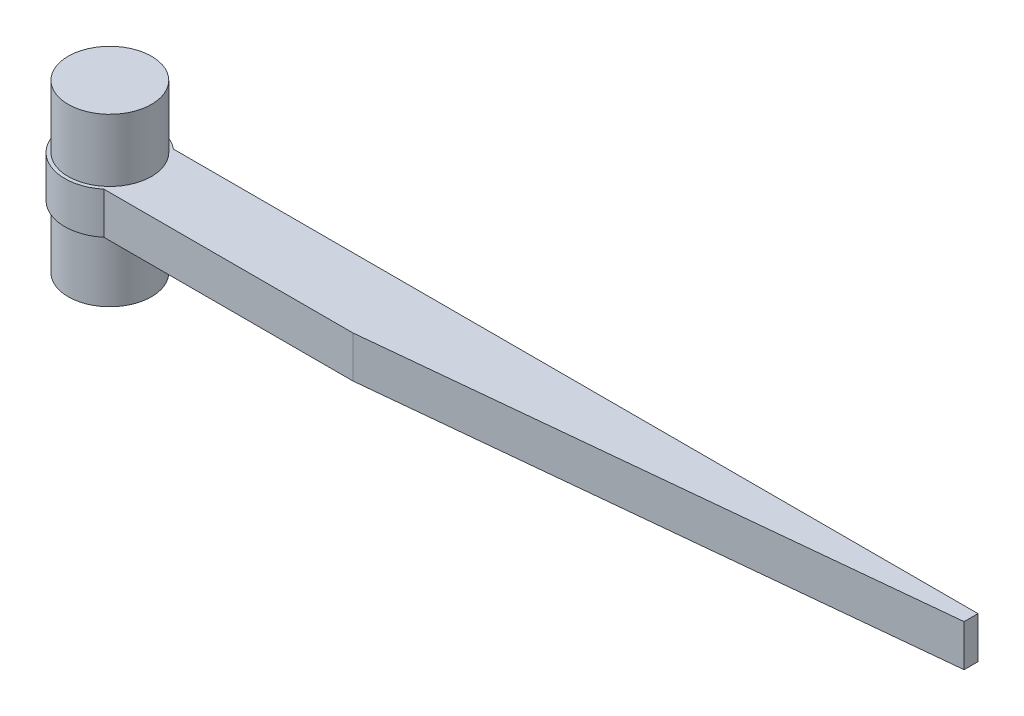
ISO-10303-21;
HEADER;
FILE_DESCRIPTION(('STEP AP214'),'2;1');
FILE_NAME('part.step','',(''),(''),'','','');
FILE_SCHEMA(('AUTOMOTIVE_DESIGN { 1 0 10303 214 1 1 1 1 }'));
ENDSEC;
DATA;
#1=APPLICATION_CONTEXT('core data for automotive mechanical design processes');
#2=APPLICATION_PROTOCOL_DEFINITION('international standard','automotive_design',2000,#1);
#3=PRODUCT_CONTEXT('',#1,'mechanical');
#4=PRODUCT('Part','Part','',(#3));
#5=PRODUCT_RELATED_PRODUCT_CATEGORY('part','',(#4));
#6=PRODUCT_DEFINITION_FORMATION('','',#4);
#7=PRODUCT_DEFINITION_CONTEXT('part definition',#1,'design');
#8=PRODUCT_DEFINITION('design','',#6,#7);
#9=PRODUCT_DEFINITION_SHAPE('','',#8);
#10=(LENGTH_UNIT() NAMED_UNIT(*) SI_UNIT(.MILLI.,.METRE.));
#11=(NAMED_UNIT(*) PLANE_ANGLE_UNIT() SI_UNIT($,.RADIAN.));
#12=(NAMED_UNIT(*) SI_UNIT($,.STERADIAN.) SOLID_ANGLE_UNIT());
#13=UNCERTAINTY_MEASURE_WITH_UNIT(LENGTH_MEASURE(1.E-05),#10,'distance_accuracy_value','');
#14=(GEOMETRIC_REPRESENTATION_CONTEXT(3) GLOBAL_UNCERTAINTY_ASSIGNED_CONTEXT((#13)) GLOBAL_UNIT_ASSIGNED_CONTEXT((#10,
#11,#12)) REPRESENTATION_CONTEXT('',''));
#15=CARTESIAN_POINT('',(0.,0.,0.));
#16=DIRECTION('',(0.,0.,1.));
#17=DIRECTION('',(1.,0.,0.));
#18=AXIS2_PLACEMENT_3D('',#15,#16,#17);
#19=CARTESIAN_POINT('',(0.,1.5,0.));
#20=DIRECTION('',(0.,-1.,0.));
#21=DIRECTION('',(0.,0.,-1.));
#22=AXIS2_PLACEMENT_3D('',#19,#20,#21);
#23=CYLINDRICAL_SURFACE('',#22,3.25);
#24=CARTESIAN_POINT('',(0.,-1.5,0.));
#25=DIRECTION('',(0.,1.,0.));
#26=DIRECTION('',(0.,0.,1.));
#27=AXIS2_PLACEMENT_3D('',#24,#25,#26);
#28=CIRCLE('',#27,3.25);
#29=CARTESIAN_POINT('',(2.07665596572952,-1.5,-2.5));
#30=VERTEX_POINT('',#29);
#31=CARTESIAN_POINT('',(2.07665596572952,-1.5,2.5));
#32=VERTEX_POINT('',#31);
#33=EDGE_CURVE('E92',#30,#32,#28,.T.);
#34=ORIENTED_EDGE('',*,*,#33,.T.);
#35=DIRECTION('',(0.,-1.,0.));
#36=VECTOR('',#35,1.);
#37=CARTESIAN_POINT('',(2.07665596572952,1.5,2.5));
#38=LINE('',#37,#36);
#39=CARTESIAN_POINT('',(2.07665596572952,1.5,2.5));
#40=VERTEX_POINT('',#39);
#41=EDGE_CURVE('E108',#32,#40,#38,.F.);
#42=ORIENTED_EDGE('',*,*,#41,.T.);
#43=CARTESIAN_POINT('',(0.,1.5,0.));
#44=DIRECTION('',(0.,1.,0.));
#45=DIRECTION('',(0.,0.,1.));
#46=AXIS2_PLACEMENT_3D('',#43,#44,#45);
#47=CIRCLE('',#46,3.25);
#48=CARTESIAN_POINT('',(2.07665596572952,1.5,-2.5));
#49=VERTEX_POINT('',#48);
#50=EDGE_CURVE('E120',#49,#40,#47,.T.);
#51=ORIENTED_EDGE('',*,*,#50,.F.);
#52=DIRECTION('',(0.,-1.,0.));
#53=VECTOR('',#52,1.);
#54=CARTESIAN_POINT('',(2.07665596572952,1.5,-2.5));
#55=LINE('',#54,#53);
#56=EDGE_CURVE('E83',#30,#49,#55,.F.);
#57=ORIENTED_EDGE('',*,*,#56,.F.);
#58=EDGE_LOOP('',(#34,#42,#51,#57));
#59=FACE_BOUND('',#58,.T.);
#60=ADVANCED_FACE('F32',(#59),#23,.T.);
#61=CARTESIAN_POINT('',(0.,1.5,0.));
#62=DIRECTION('',(0.,1.,0.));
#63=DIRECTION('',(0.,0.,1.));
#64=AXIS2_PLACEMENT_3D('',#61,#62,#63);
#65=PLANE('',#64);
#66=DIRECTION('',(-1.,0.,0.));
#67=VECTOR('',#66,1.);
#68=CARTESIAN_POINT('',(0.,1.5,2.5));
#69=LINE('',#68,#67);
#70=CARTESIAN_POINT('',(19.9999999999986,1.5,2.5));
#71=VERTEX_POINT('',#70);
#72=EDGE_CURVE('E105',#71,#40,#69,.T.);
#73=ORIENTED_EDGE('',*,*,#72,.F.);
#74=DIRECTION('',(0.995037190209989,0.,-0.0995037190209955));
#75=VECTOR('',#74,1.);
#76=CARTESIAN_POINT('',(0.445544554455409,1.5,4.45544554455425));
#77=LINE('',#76,#75);
#78=CARTESIAN_POINT('',(60.,1.5,-1.5));
#79=VERTEX_POINT('',#78);
#80=EDGE_CURVE('E54',#71,#79,#77,.T.);
#81=ORIENTED_EDGE('',*,*,#80,.T.);
#82=DIRECTION('',(0.,0.,-1.));
#83=VECTOR('',#82,1.);
#84=CARTESIAN_POINT('',(60.,1.5,2.5));
#85=LINE('',#84,#83);
#86=CARTESIAN_POINT('',(60.,1.5,-2.5));
#87=VERTEX_POINT('',#86);
#88=EDGE_CURVE('E84',#79,#87,#85,.T.);
#89=ORIENTED_EDGE('',*,*,#88,.T.);
#90=DIRECTION('',(-1.,0.,0.));
#91=VECTOR('',#90,1.);
#92=CARTESIAN_POINT('',(0.,1.5,-2.5));
#93=LINE('',#92,#91);
#94=EDGE_CURVE('E99',#87,#49,#93,.T.);
#95=ORIENTED_EDGE('',*,*,#94,.T.);
#96=ORIENTED_EDGE('',*,*,#50,.T.);
#97=EDGE_LOOP('',(#73,#81,#89,#95,#96));
#98=FACE_BOUND('',#97,.T.);
#99=CARTESIAN_POINT('',(0.,1.5,0.));
#100=DIRECTION('',(0.,1.,0.));
#101=DIRECTION('',(0.,0.,1.));
#102=AXIS2_PLACEMENT_3D('',#99,#100,#101);
#103=CIRCLE('',#102,3.);
#104=CARTESIAN_POINT('',(0.,1.5,3.));
#105=VERTEX_POINT('',#104);
#106=EDGE_CURVE('E115',#105,#105,#103,.F.);
#107=ORIENTED_EDGE('',*,*,#106,.T.);
#108=EDGE_LOOP('',(#107));
#109=FACE_BOUND('',#108,.T.);
#110=ADVANCED_FACE('F136',(#98,#109),#65,.T.);
#111=CARTESIAN_POINT('',(0.,-1.5,0.));
#112=DIRECTION('',(0.,1.,0.));
#113=DIRECTION('',(0.,0.,1.));
#114=AXIS2_PLACEMENT_3D('',#111,#112,#113);
#115=PLANE('',#114);
#116=DIRECTION('',(0.,0.,-1.));
#117=VECTOR('',#116,1.);
#118=CARTESIAN_POINT('',(60.,-1.5,2.5));
#119=LINE('',#118,#117);
#120=CARTESIAN_POINT('',(60.,-1.5,-1.5));
#121=VERTEX_POINT('',#120);
#122=CARTESIAN_POINT('',(60.,-1.5,-2.5));
#123=VERTEX_POINT('',#122);
#124=EDGE_CURVE('E75',#121,#123,#119,.T.);
#125=ORIENTED_EDGE('',*,*,#124,.F.);
#126=DIRECTION('',(-0.995037190209989,0.,0.0995037190209955));
#127=VECTOR('',#126,1.);
#128=CARTESIAN_POINT('',(19.9999999999986,-1.5,2.5));
#129=LINE('',#128,#127);
#130=CARTESIAN_POINT('',(19.9999999999986,-1.5,2.5));
#131=VERTEX_POINT('',#130);
#132=EDGE_CURVE('E11',#121,#131,#129,.T.);
#133=ORIENTED_EDGE('',*,*,#132,.T.);
#134=DIRECTION('',(1.,0.,0.));
#135=VECTOR('',#134,1.);
#136=CARTESIAN_POINT('',(0.,-1.5,2.5));
#137=LINE('',#136,#135);
#138=EDGE_CURVE('E101',#32,#131,#137,.T.);
#139=ORIENTED_EDGE('',*,*,#138,.F.);
#140=ORIENTED_EDGE('',*,*,#33,.F.);
#141=DIRECTION('',(1.,0.,0.));
#142=VECTOR('',#141,1.);
#143=CARTESIAN_POINT('',(0.,-1.5,-2.5));
#144=LINE('',#143,#142);
#145=EDGE_CURVE('E88',#30,#123,#144,.T.);
#146=ORIENTED_EDGE('',*,*,#145,.T.);
#147=EDGE_LOOP('',(#125,#133,#139,#140,#146));
#148=FACE_BOUND('',#147,.T.);
#149=CARTESIAN_POINT('',(0.,-1.5,0.));
#150=DIRECTION('',(0.,1.,0.));
#151=DIRECTION('',(0.,0.,1.));
#152=AXIS2_PLACEMENT_3D('',#149,#150,#151);
#153=CIRCLE('',#152,3.);
#154=CARTESIAN_POINT('',(0.,-1.5,3.));
#155=VERTEX_POINT('',#154);
#156=EDGE_CURVE('E123',#155,#155,#153,.F.);
#157=ORIENTED_EDGE('',*,*,#156,.F.);
#158=EDGE_LOOP('',(#157));
#159=FACE_BOUND('',#158,.T.);
#160=ADVANCED_FACE('F89',(#148,#159),#115,.F.);
#161=CARTESIAN_POINT('',(0.,-6.,0.));
#162=DIRECTION('',(0.,1.,0.));
#163=DIRECTION('',(0.,0.,1.));
#164=AXIS2_PLACEMENT_3D('',#161,#162,#163);
#165=PLANE('',#164);
#166=CARTESIAN_POINT('',(0.,-6.,0.));
#167=DIRECTION('',(0.,1.,0.));
#168=DIRECTION('',(0.,0.,1.));
#169=AXIS2_PLACEMENT_3D('',#166,#167,#168);
#170=CIRCLE('',#169,3.);
#171=CARTESIAN_POINT('',(0.,-6.,3.));
#172=VERTEX_POINT('',#171);
#173=EDGE_CURVE('E111',#172,#172,#170,.T.);
#174=ORIENTED_EDGE('',*,*,#173,.F.);
#175=EDGE_LOOP('',(#174));
#176=FACE_BOUND('',#175,.T.);
#177=ADVANCED_FACE('F260',(#176),#165,.F.);
#178=CARTESIAN_POINT('',(0.,6.,0.));
#179=DIRECTION('',(0.,-1.,0.));
#180=DIRECTION('',(0.,0.,-1.));
#181=AXIS2_PLACEMENT_3D('',#178,#179,#180);
#182=CYLINDRICAL_SURFACE('',#181,3.);
#183=ORIENTED_EDGE('',*,*,#173,.T.);
#184=EDGE_LOOP('',(#183));
#185=FACE_BOUND('',#184,.T.);
#186=ORIENTED_EDGE('',*,*,#156,.T.);
#187=EDGE_LOOP('',(#186));
#188=FACE_BOUND('',#187,.T.);
#189=ADVANCED_FACE('F266',(#185,#188),#182,.T.);
#190=ORIENTED_EDGE('',*,*,#106,.F.);
#191=EDGE_LOOP('',(#190));
#192=FACE_BOUND('',#191,.T.);
#193=CARTESIAN_POINT('',(0.,6.,0.));
#194=DIRECTION('',(0.,1.,0.));
#195=DIRECTION('',(0.,0.,1.));
#196=AXIS2_PLACEMENT_3D('',#193,#194,#195);
#197=CIRCLE('',#196,3.);
#198=CARTESIAN_POINT('',(0.,6.,3.));
#199=VERTEX_POINT('',#198);
#200=EDGE_CURVE('E112',#199,#199,#197,.T.);
#201=ORIENTED_EDGE('',*,*,#200,.F.);
#202=EDGE_LOOP('',(#201));
#203=FACE_BOUND('',#202,.T.);
#204=ADVANCED_FACE('F262',(#192,#203),#182,.T.);
#205=CARTESIAN_POINT('',(0.,6.,0.));
#206=DIRECTION('',(0.,1.,0.));
#207=DIRECTION('',(0.,0.,1.));
#208=AXIS2_PLACEMENT_3D('',#205,#206,#207);
#209=PLANE('',#208);
#210=ORIENTED_EDGE('',*,*,#200,.T.);
#211=EDGE_LOOP('',(#210));
#212=FACE_BOUND('',#211,.T.);
#213=ADVANCED_FACE('F265',(#212),#209,.T.);
#214=CARTESIAN_POINT('',(0.,0.,2.5));
#215=DIRECTION('',(0.,0.,1.));
#216=DIRECTION('',(1.,0.,0.));
#217=AXIS2_PLACEMENT_3D('',#214,#215,#216);
#218=PLANE('',#217);
#219=ORIENTED_EDGE('',*,*,#138,.T.);
#220=DIRECTION('',(0.,1.,0.));
#221=VECTOR('',#220,1.);
#222=CARTESIAN_POINT('',(19.9999999999986,1.5,2.5));
#223=LINE('',#222,#221);
#224=EDGE_CURVE('E127',#131,#71,#223,.T.);
#225=ORIENTED_EDGE('',*,*,#224,.T.);
#226=ORIENTED_EDGE('',*,*,#72,.T.);
#227=ORIENTED_EDGE('',*,*,#41,.F.);
#228=EDGE_LOOP('',(#219,#225,#226,#227));
#229=FACE_BOUND('',#228,.T.);
#230=ADVANCED_FACE('F133',(#229),#218,.T.);
#231=CARTESIAN_POINT('',(0.,0.,-2.5));
#232=DIRECTION('',(0.,0.,1.));
#233=DIRECTION('',(1.,0.,0.));
#234=AXIS2_PLACEMENT_3D('',#231,#232,#233);
#235=PLANE('',#234);
#236=CARTESIAN_POINT('',(56.0447280958672,-3.49148133884313E-13,-2.5));
#237=DIRECTION('',(0.,0.,-1.));
#238=DIRECTION('',(-1.,0.,0.));
#239=AXIS2_PLACEMENT_3D('',#236,#237,#238);
#240=CIRCLE('',#239,0.85);
#241=CARTESIAN_POINT('',(55.1947280958672,-3.49148133884313E-13,-2.5));
#242=VERTEX_POINT('',#241);
#243=EDGE_CURVE('E200',#242,#242,#240,.T.);
#244=ORIENTED_EDGE('',*,*,#243,.F.);
#245=EDGE_LOOP('',(#244));
#246=FACE_BOUND('',#245,.T.);
#247=CARTESIAN_POINT('',(51.0447280958672,-3.14233320495882E-13,-2.5));
#248=DIRECTION('',(0.,0.,-1.));
#249=DIRECTION('',(-1.,0.,0.));
#250=AXIS2_PLACEMENT_3D('',#247,#248,#249);
#251=CIRCLE('',#250,0.85);
#252=CARTESIAN_POINT('',(50.1947280958672,-3.14233320495882E-13,-2.5));
#253=VERTEX_POINT('',#252);
#254=EDGE_CURVE('E194',#253,#253,#251,.T.);
#255=ORIENTED_EDGE('',*,*,#254,.F.);
#256=EDGE_LOOP('',(#255));
#257=FACE_BOUND('',#256,.T.);
#258=CARTESIAN_POINT('',(46.0447280958672,-2.79318507107451E-13,-2.5));
#259=DIRECTION('',(0.,0.,-1.));
#260=DIRECTION('',(-1.,0.,0.));
#261=AXIS2_PLACEMENT_3D('',#258,#259,#260);
#262=CIRCLE('',#261,0.85);
#263=CARTESIAN_POINT('',(45.1947280958672,-2.79318507107451E-13,-2.5));
#264=VERTEX_POINT('',#263);
#265=EDGE_CURVE('E188',#264,#264,#262,.T.);
#266=ORIENTED_EDGE('',*,*,#265,.F.);
#267=EDGE_LOOP('',(#266));
#268=FACE_BOUND('',#267,.T.);
#269=CARTESIAN_POINT('',(41.0447280958672,-2.44403693719019E-13,-2.5));
#270=DIRECTION('',(0.,0.,-1.));
#271=DIRECTION('',(-1.,0.,0.));
#272=AXIS2_PLACEMENT_3D('',#269,#270,#271);
#273=CIRCLE('',#272,0.85);
#274=CARTESIAN_POINT('',(40.1947280958672,-2.44403693719019E-13,-2.5));
#275=VERTEX_POINT('',#274);
#276=EDGE_CURVE('E182',#275,#275,#273,.T.);
#277=ORIENTED_EDGE('',*,*,#276,.F.);
#278=EDGE_LOOP('',(#277));
#279=FACE_BOUND('',#278,.T.);
#280=CARTESIAN_POINT('',(36.0447280958672,-2.09488880330588E-13,-2.5));
#281=DIRECTION('',(0.,0.,-1.));
#282=DIRECTION('',(-1.,0.,0.));
#283=AXIS2_PLACEMENT_3D('',#280,#281,#282);
#284=CIRCLE('',#283,0.85);
#285=CARTESIAN_POINT('',(35.1947280958672,-2.09488880330588E-13,-2.5));
#286=VERTEX_POINT('',#285);
#287=EDGE_CURVE('E176',#286,#286,#284,.T.);
#288=ORIENTED_EDGE('',*,*,#287,.F.);
#289=EDGE_LOOP('',(#288));
#290=FACE_BOUND('',#289,.T.);
#291=CARTESIAN_POINT('',(31.0447280958672,-1.74574066942157E-13,-2.5));
#292=DIRECTION('',(0.,0.,-1.));
#293=DIRECTION('',(-1.,0.,0.));
#294=AXIS2_PLACEMENT_3D('',#291,#292,#293);
#295=CIRCLE('',#294,0.85);
#296=CARTESIAN_POINT('',(30.1947280958672,-1.74574066942157E-13,-2.5));
#297=VERTEX_POINT('',#296);
#298=EDGE_CURVE('E170',#297,#297,#295,.T.);
#299=ORIENTED_EDGE('',*,*,#298,.F.);
#300=EDGE_LOOP('',(#299));
#301=FACE_BOUND('',#300,.T.);
#302=CARTESIAN_POINT('',(26.0447280958672,-1.39659253553725E-13,-2.5));
#303=DIRECTION('',(0.,0.,-1.));
#304=DIRECTION('',(-1.,0.,0.));
#305=AXIS2_PLACEMENT_3D('',#302,#303,#304);
#306=CIRCLE('',#305,0.85);
#307=CARTESIAN_POINT('',(25.1947280958672,-1.39659253553725E-13,-2.5));
#308=VERTEX_POINT('',#307);
#309=EDGE_CURVE('E164',#308,#308,#306,.T.);
#310=ORIENTED_EDGE('',*,*,#309,.F.);
#311=EDGE_LOOP('',(#310));
#312=FACE_BOUND('',#311,.T.);
#313=CARTESIAN_POINT('',(21.0447280958672,-1.04744440165294E-13,-2.5));
#314=DIRECTION('',(0.,0.,-1.));
#315=DIRECTION('',(-1.,0.,0.));
#316=AXIS2_PLACEMENT_3D('',#313,#314,#315);
#317=CIRCLE('',#316,0.85);
#318=CARTESIAN_POINT('',(20.1947280958672,-1.04744440165294E-13,-2.5));
#319=VERTEX_POINT('',#318);
#320=EDGE_CURVE('E158',#319,#319,#317,.T.);
#321=ORIENTED_EDGE('',*,*,#320,.F.);
#322=EDGE_LOOP('',(#321));
#323=FACE_BOUND('',#322,.T.);
#324=CARTESIAN_POINT('',(16.0447280958672,0.,-2.5));
#325=DIRECTION('',(0.,0.,-1.));
#326=DIRECTION('',(-1.,0.,0.));
#327=AXIS2_PLACEMENT_3D('',#324,#325,#326);
#328=CIRCLE('',#327,0.850000000000001);
#329=CARTESIAN_POINT('',(15.1947280958672,0.,-2.5));
#330=VERTEX_POINT('',#329);
#331=EDGE_CURVE('E152',#330,#330,#328,.T.);
#332=ORIENTED_EDGE('',*,*,#331,.F.);
#333=EDGE_LOOP('',(#332));
#334=FACE_BOUND('',#333,.T.);
#335=CARTESIAN_POINT('',(11.0447280958672,0.,-2.5));
#336=DIRECTION('',(0.,0.,-1.));
#337=DIRECTION('',(-1.,0.,0.));
#338=AXIS2_PLACEMENT_3D('',#335,#336,#337);
#339=CIRCLE('',#338,0.85);
#340=CARTESIAN_POINT('',(10.1947280958672,0.,-2.5));
#341=VERTEX_POINT('',#340);
#342=EDGE_CURVE('E146',#341,#341,#339,.T.);
#343=ORIENTED_EDGE('',*,*,#342,.F.);
#344=EDGE_LOOP('',(#343));
#345=FACE_BOUND('',#344,.T.);
#346=CARTESIAN_POINT('',(6.04472809586716,0.,-2.5));
#347=DIRECTION('',(0.,0.,-1.));
#348=DIRECTION('',(-1.,0.,0.));
#349=AXIS2_PLACEMENT_3D('',#346,#347,#348);
#350=CIRCLE('',#349,0.85);
#351=CARTESIAN_POINT('',(5.19472809586716,0.,-2.5));
#352=VERTEX_POINT('',#351);
#353=EDGE_CURVE('E140',#352,#352,#350,.T.);
#354=ORIENTED_EDGE('',*,*,#353,.F.);
#355=EDGE_LOOP('',(#354));
#356=FACE_BOUND('',#355,.T.);
#357=ORIENTED_EDGE('',*,*,#145,.F.);
#358=ORIENTED_EDGE('',*,*,#56,.T.);
#359=ORIENTED_EDGE('',*,*,#94,.F.);
#360=DIRECTION('',(0.,1.,0.));
#361=VECTOR('',#360,1.);
#362=CARTESIAN_POINT('',(60.,1.5,-2.5));
#363=LINE('',#362,#361);
#364=EDGE_CURVE('E79',#123,#87,#363,.T.);
#365=ORIENTED_EDGE('',*,*,#364,.F.);
#366=EDGE_LOOP('',(#357,#358,#359,#365));
#367=FACE_BOUND('',#366,.T.);
#368=ADVANCED_FACE('F97',(#246,#257,#268,#279,#290,#301,#312,#323,#334,#345,#356,#367),#235,.F.);
#369=CARTESIAN_POINT('',(60.,1.5,2.5));
#370=DIRECTION('',(-1.,0.,0.));
#371=DIRECTION('',(0.,0.,1.));
#372=AXIS2_PLACEMENT_3D('',#369,#370,#371);
#373=PLANE('',#372);
#374=ORIENTED_EDGE('',*,*,#88,.F.);
#375=DIRECTION('',(0.,-1.,0.));
#376=VECTOR('',#375,1.);
#377=CARTESIAN_POINT('',(60.,-1.5,-1.5));
#378=LINE('',#377,#376);
#379=EDGE_CURVE('E40',#79,#121,#378,.T.);
#380=ORIENTED_EDGE('',*,*,#379,.T.);
#381=ORIENTED_EDGE('',*,*,#124,.T.);
#382=ORIENTED_EDGE('',*,*,#364,.T.);
#383=EDGE_LOOP('',(#374,#380,#381,#382));
#384=FACE_BOUND('',#383,.T.);
#385=ADVANCED_FACE('F77',(#384),#373,.F.);
#386=CARTESIAN_POINT('',(19.9999999999986,0.,2.5));
#387=DIRECTION('',(0.0995037190209955,0.,0.995037190209989));
#388=DIRECTION('',(0.,-1.,0.));
#389=AXIS2_PLACEMENT_3D('',#386,#387,#388);
#390=PLANE('',#389);
#391=ORIENTED_EDGE('',*,*,#132,.F.);
#392=ORIENTED_EDGE('',*,*,#379,.F.);
#393=ORIENTED_EDGE('',*,*,#80,.F.);
#394=ORIENTED_EDGE('',*,*,#224,.F.);
#395=EDGE_LOOP('',(#391,#392,#393,#394));
#396=FACE_BOUND('',#395,.T.);
#397=ADVANCED_FACE('F34',(#396),#390,.T.);
#398=CARTESIAN_POINT('',(6.04472809586716,0.,-2.));
#399=DIRECTION('',(0.,0.,-1.));
#400=DIRECTION('',(-1.,0.,0.));
#401=AXIS2_PLACEMENT_3D('',#398,#399,#400);
#402=CYLINDRICAL_SURFACE('',#401,0.85);
#403=CARTESIAN_POINT('',(6.04472809586716,0.,-2.));
#404=DIRECTION('',(0.,0.,-1.));
#405=DIRECTION('',(-1.,0.,0.));
#406=AXIS2_PLACEMENT_3D('',#403,#404,#405);
#407=CIRCLE('',#406,0.85);
#408=CARTESIAN_POINT('',(5.19472809586716,0.,-2.));
#409=VERTEX_POINT('',#408);
#410=EDGE_CURVE('E95',#409,#409,#407,.T.);
#411=ORIENTED_EDGE('',*,*,#410,.F.);
#412=EDGE_LOOP('',(#411));
#413=FACE_BOUND('',#412,.T.);
#414=ORIENTED_EDGE('',*,*,#353,.T.);
#415=EDGE_LOOP('',(#414));
#416=FACE_BOUND('',#415,.T.);
#417=ADVANCED_FACE('F238',(#413,#416),#402,.F.);
#418=CARTESIAN_POINT('',(6.04472809586716,0.,-2.));
#419=DIRECTION('',(0.,0.,-1.));
#420=DIRECTION('',(-1.,0.,0.));
#421=AXIS2_PLACEMENT_3D('',#418,#419,#420);
#422=PLANE('',#421);
#423=ORIENTED_EDGE('',*,*,#410,.T.);
#424=EDGE_LOOP('',(#423));
#425=FACE_BOUND('',#424,.T.);
#426=ADVANCED_FACE('F240',(#425),#422,.T.);
#427=CARTESIAN_POINT('',(11.0447280958672,0.,-2.));
#428=DIRECTION('',(0.,0.,-1.));
#429=DIRECTION('',(-1.,0.,0.));
#430=AXIS2_PLACEMENT_3D('',#427,#428,#429);
#431=CYLINDRICAL_SURFACE('',#430,0.85);
#432=CARTESIAN_POINT('',(11.0447280958672,0.,-2.));
#433=DIRECTION('',(0.,0.,-1.));
#434=DIRECTION('',(-1.,0.,0.));
#435=AXIS2_PLACEMENT_3D('',#432,#433,#434);
#436=CIRCLE('',#435,0.85);
#437=CARTESIAN_POINT('',(10.1947280958672,0.,-2.));
#438=VERTEX_POINT('',#437);
#439=EDGE_CURVE('E143',#438,#438,#436,.T.);
#440=ORIENTED_EDGE('',*,*,#439,.F.);
#441=EDGE_LOOP('',(#440));
#442=FACE_BOUND('',#441,.T.);
#443=ORIENTED_EDGE('',*,*,#342,.T.);
#444=EDGE_LOOP('',(#443));
#445=FACE_BOUND('',#444,.T.);
#446=ADVANCED_FACE('F247',(#442,#445),#431,.F.);
#447=CARTESIAN_POINT('',(11.0447280958672,0.,-2.));
#448=DIRECTION('',(0.,0.,-1.));
#449=DIRECTION('',(-1.,0.,0.));
#450=AXIS2_PLACEMENT_3D('',#447,#448,#449);
#451=PLANE('',#450);
#452=ORIENTED_EDGE('',*,*,#439,.T.);
#453=EDGE_LOOP('',(#452));
#454=FACE_BOUND('',#453,.T.);
#455=ADVANCED_FACE('F314',(#454),#451,.T.);
#456=CARTESIAN_POINT('',(16.0447280958672,0.,-2.));
#457=DIRECTION('',(0.,0.,-1.));
#458=DIRECTION('',(-1.,0.,0.));
#459=AXIS2_PLACEMENT_3D('',#456,#457,#458);
#460=CYLINDRICAL_SURFACE('',#459,0.850000000000001);
#461=CARTESIAN_POINT('',(16.0447280958672,0.,-2.));
#462=DIRECTION('',(0.,0.,-1.));
#463=DIRECTION('',(-1.,0.,0.));
#464=AXIS2_PLACEMENT_3D('',#461,#462,#463);
#465=CIRCLE('',#464,0.850000000000001);
#466=CARTESIAN_POINT('',(15.1947280958672,0.,-2.));
#467=VERTEX_POINT('',#466);
#468=EDGE_CURVE('E149',#467,#467,#465,.T.);
#469=ORIENTED_EDGE('',*,*,#468,.F.);
#470=EDGE_LOOP('',(#469));
#471=FACE_BOUND('',#470,.T.);
#472=ORIENTED_EDGE('',*,*,#331,.T.);
#473=EDGE_LOOP('',(#472));
#474=FACE_BOUND('',#473,.T.);
#475=ADVANCED_FACE('F323',(#471,#474),#460,.F.);
#476=CARTESIAN_POINT('',(16.0447280958672,0.,-2.));
#477=DIRECTION('',(0.,0.,-1.));
#478=DIRECTION('',(-1.,0.,0.));
#479=AXIS2_PLACEMENT_3D('',#476,#477,#478);
#480=PLANE('',#479);
#481=ORIENTED_EDGE('',*,*,#468,.T.);
#482=EDGE_LOOP('',(#481));
#483=FACE_BOUND('',#482,.T.);
#484=ADVANCED_FACE('F332',(#483),#480,.T.);
#485=CARTESIAN_POINT('',(21.0447280958672,-1.04744440165294E-13,-2.));
#486=DIRECTION('',(0.,0.,-1.));
#487=DIRECTION('',(-1.,0.,0.));
#488=AXIS2_PLACEMENT_3D('',#485,#486,#487);
#489=CYLINDRICAL_SURFACE('',#488,0.85);
#490=CARTESIAN_POINT('',(21.0447280958672,-1.04744440165294E-13,-2.));
#491=DIRECTION('',(0.,0.,-1.));
#492=DIRECTION('',(-1.,0.,0.));
#493=AXIS2_PLACEMENT_3D('',#490,#491,#492);
#494=CIRCLE('',#493,0.85);
#495=CARTESIAN_POINT('',(20.1947280958672,-1.04744440165294E-13,-2.));
#496=VERTEX_POINT('',#495);
#497=EDGE_CURVE('E155',#496,#496,#494,.T.);
#498=ORIENTED_EDGE('',*,*,#497,.F.);
#499=EDGE_LOOP('',(#498));
#500=FACE_BOUND('',#499,.T.);
#501=ORIENTED_EDGE('',*,*,#320,.T.);
#502=EDGE_LOOP('',(#501));
#503=FACE_BOUND('',#502,.T.);
#504=ADVANCED_FACE('F341',(#500,#503),#489,.F.);
#505=CARTESIAN_POINT('',(21.0447280958672,-1.04744440165294E-13,-2.));
#506=DIRECTION('',(0.,0.,-1.));
#507=DIRECTION('',(-1.,0.,0.));
#508=AXIS2_PLACEMENT_3D('',#505,#506,#507);
#509=PLANE('',#508);
#510=ORIENTED_EDGE('',*,*,#497,.T.);
#511=EDGE_LOOP('',(#510));
#512=FACE_BOUND('',#511,.T.);
#513=ADVANCED_FACE('F350',(#512),#509,.T.);
#514=CARTESIAN_POINT('',(26.0447280958672,-1.39659253553725E-13,-2.));
#515=DIRECTION('',(0.,0.,-1.));
#516=DIRECTION('',(-1.,0.,0.));
#517=AXIS2_PLACEMENT_3D('',#514,#515,#516);
#518=CYLINDRICAL_SURFACE('',#517,0.85);
#519=CARTESIAN_POINT('',(26.0447280958672,-1.39659253553725E-13,-2.));
#520=DIRECTION('',(0.,0.,-1.));
#521=DIRECTION('',(-1.,0.,0.));
#522=AXIS2_PLACEMENT_3D('',#519,#520,#521);
#523=CIRCLE('',#522,0.85);
#524=CARTESIAN_POINT('',(25.1947280958672,-1.39659253553725E-13,-2.));
#525=VERTEX_POINT('',#524);
#526=EDGE_CURVE('E161',#525,#525,#523,.T.);
#527=ORIENTED_EDGE('',*,*,#526,.F.);
#528=EDGE_LOOP('',(#527));
#529=FACE_BOUND('',#528,.T.);
#530=ORIENTED_EDGE('',*,*,#309,.T.);
#531=EDGE_LOOP('',(#530));
#532=FACE_BOUND('',#531,.T.);
#533=ADVANCED_FACE('F359',(#529,#532),#518,.F.);
#534=CARTESIAN_POINT('',(26.0447280958672,-1.39659253553725E-13,-2.));
#535=DIRECTION('',(0.,0.,-1.));
#536=DIRECTION('',(-1.,0.,0.));
#537=AXIS2_PLACEMENT_3D('',#534,#535,#536);
#538=PLANE('',#537);
#539=ORIENTED_EDGE('',*,*,#526,.T.);
#540=EDGE_LOOP('',(#539));
#541=FACE_BOUND('',#540,.T.);
#542=ADVANCED_FACE('F368',(#541),#538,.T.);
#543=CARTESIAN_POINT('',(31.0447280958672,-1.74574066942157E-13,-2.));
#544=DIRECTION('',(0.,0.,-1.));
#545=DIRECTION('',(-1.,0.,0.));
#546=AXIS2_PLACEMENT_3D('',#543,#544,#545);
#547=CYLINDRICAL_SURFACE('',#546,0.85);
#548=CARTESIAN_POINT('',(31.0447280958672,-1.74574066942157E-13,-2.));
#549=DIRECTION('',(0.,0.,-1.));
#550=DIRECTION('',(-1.,0.,0.));
#551=AXIS2_PLACEMENT_3D('',#548,#549,#550);
#552=CIRCLE('',#551,0.85);
#553=CARTESIAN_POINT('',(30.1947280958672,-1.74574066942157E-13,-2.));
#554=VERTEX_POINT('',#553);
#555=EDGE_CURVE('E167',#554,#554,#552,.T.);
#556=ORIENTED_EDGE('',*,*,#555,.F.);
#557=EDGE_LOOP('',(#556));
#558=FACE_BOUND('',#557,.T.);
#559=ORIENTED_EDGE('',*,*,#298,.T.);
#560=EDGE_LOOP('',(#559));
#561=FACE_BOUND('',#560,.T.);
#562=ADVANCED_FACE('F377',(#558,#561),#547,.F.);
#563=CARTESIAN_POINT('',(31.0447280958672,-1.74574066942157E-13,-2.));
#564=DIRECTION('',(0.,0.,-1.));
#565=DIRECTION('',(-1.,0.,0.));
#566=AXIS2_PLACEMENT_3D('',#563,#564,#565);
#567=PLANE('',#566);
#568=ORIENTED_EDGE('',*,*,#555,.T.);
#569=EDGE_LOOP('',(#568));
#570=FACE_BOUND('',#569,.T.);
#571=ADVANCED_FACE('F386',(#570),#567,.T.);
#572=CARTESIAN_POINT('',(36.0447280958672,-2.09488880330588E-13,-2.));
#573=DIRECTION('',(0.,0.,-1.));
#574=DIRECTION('',(-1.,0.,0.));
#575=AXIS2_PLACEMENT_3D('',#572,#573,#574);
#576=CYLINDRICAL_SURFACE('',#575,0.85);
#577=CARTESIAN_POINT('',(36.0447280958672,-2.09488880330588E-13,-2.));
#578=DIRECTION('',(0.,0.,-1.));
#579=DIRECTION('',(-1.,0.,0.));
#580=AXIS2_PLACEMENT_3D('',#577,#578,#579);
#581=CIRCLE('',#580,0.85);
#582=CARTESIAN_POINT('',(35.1947280958672,-2.09488880330588E-13,-2.));
#583=VERTEX_POINT('',#582);
#584=EDGE_CURVE('E173',#583,#583,#581,.T.);
#585=ORIENTED_EDGE('',*,*,#584,.F.);
#586=EDGE_LOOP('',(#585));
#587=FACE_BOUND('',#586,.T.);
#588=ORIENTED_EDGE('',*,*,#287,.T.);
#589=EDGE_LOOP('',(#588));
#590=FACE_BOUND('',#589,.T.);
#591=ADVANCED_FACE('F395',(#587,#590),#576,.F.);
#592=CARTESIAN_POINT('',(36.0447280958672,-2.09488880330588E-13,-2.));
#593=DIRECTION('',(0.,0.,-1.));
#594=DIRECTION('',(-1.,0.,0.));
#595=AXIS2_PLACEMENT_3D('',#592,#593,#594);
#596=PLANE('',#595);
#597=ORIENTED_EDGE('',*,*,#584,.T.);
#598=EDGE_LOOP('',(#597));
#599=FACE_BOUND('',#598,.T.);
#600=ADVANCED_FACE('F404',(#599),#596,.T.);
#601=CARTESIAN_POINT('',(41.0447280958672,-2.44403693719019E-13,-2.));
#602=DIRECTION('',(0.,0.,-1.));
#603=DIRECTION('',(-1.,0.,0.));
#604=AXIS2_PLACEMENT_3D('',#601,#602,#603);
#605=CYLINDRICAL_SURFACE('',#604,0.85);
#606=CARTESIAN_POINT('',(41.0447280958672,-2.44403693719019E-13,-2.));
#607=DIRECTION('',(0.,0.,-1.));
#608=DIRECTION('',(-1.,0.,0.));
#609=AXIS2_PLACEMENT_3D('',#606,#607,#608);
#610=CIRCLE('',#609,0.85);
#611=CARTESIAN_POINT('',(40.1947280958672,-2.44403693719019E-13,-2.));
#612=VERTEX_POINT('',#611);
#613=EDGE_CURVE('E179',#612,#612,#610,.T.);
#614=ORIENTED_EDGE('',*,*,#613,.F.);
#615=EDGE_LOOP('',(#614));
#616=FACE_BOUND('',#615,.T.);
#617=ORIENTED_EDGE('',*,*,#276,.T.);
#618=EDGE_LOOP('',(#617));
#619=FACE_BOUND('',#618,.T.);
#620=ADVANCED_FACE('F413',(#616,#619),#605,.F.);
#621=CARTESIAN_POINT('',(41.0447280958672,-2.44403693719019E-13,-2.));
#622=DIRECTION('',(0.,0.,-1.));
#623=DIRECTION('',(-1.,0.,0.));
#624=AXIS2_PLACEMENT_3D('',#621,#622,#623);
#625=PLANE('',#624);
#626=ORIENTED_EDGE('',*,*,#613,.T.);
#627=EDGE_LOOP('',(#626));
#628=FACE_BOUND('',#627,.T.);
#629=ADVANCED_FACE('F422',(#628),#625,.T.);
#630=CARTESIAN_POINT('',(46.0447280958672,-2.79318507107451E-13,-2.));
#631=DIRECTION('',(0.,0.,-1.));
#632=DIRECTION('',(-1.,0.,0.));
#633=AXIS2_PLACEMENT_3D('',#630,#631,#632);
#634=CYLINDRICAL_SURFACE('',#633,0.85);
#635=CARTESIAN_POINT('',(46.0447280958672,-2.79318507107451E-13,-2.));
#636=DIRECTION('',(0.,0.,-1.));
#637=DIRECTION('',(-1.,0.,0.));
#638=AXIS2_PLACEMENT_3D('',#635,#636,#637);
#639=CIRCLE('',#638,0.85);
#640=CARTESIAN_POINT('',(45.1947280958672,-2.79318507107451E-13,-2.));
#641=VERTEX_POINT('',#640);
#642=EDGE_CURVE('E185',#641,#641,#639,.T.);
#643=ORIENTED_EDGE('',*,*,#642,.F.);
#644=EDGE_LOOP('',(#643));
#645=FACE_BOUND('',#644,.T.);
#646=ORIENTED_EDGE('',*,*,#265,.T.);
#647=EDGE_LOOP('',(#646));
#648=FACE_BOUND('',#647,.T.);
#649=ADVANCED_FACE('F431',(#645,#648),#634,.F.);
#650=CARTESIAN_POINT('',(46.0447280958672,-2.79318507107451E-13,-2.));
#651=DIRECTION('',(0.,0.,-1.));
#652=DIRECTION('',(-1.,0.,0.));
#653=AXIS2_PLACEMENT_3D('',#650,#651,#652);
#654=PLANE('',#653);
#655=ORIENTED_EDGE('',*,*,#642,.T.);
#656=EDGE_LOOP('',(#655));
#657=FACE_BOUND('',#656,.T.);
#658=ADVANCED_FACE('F440',(#657),#654,.T.);
#659=CARTESIAN_POINT('',(51.0447280958672,-3.14233320495882E-13,-2.));
#660=DIRECTION('',(0.,0.,-1.));
#661=DIRECTION('',(-1.,0.,0.));
#662=AXIS2_PLACEMENT_3D('',#659,#660,#661);
#663=CYLINDRICAL_SURFACE('',#662,0.85);
#664=CARTESIAN_POINT('',(51.0447280958672,-3.14233320495882E-13,-2.));
#665=DIRECTION('',(0.,0.,-1.));
#666=DIRECTION('',(-1.,0.,0.));
#667=AXIS2_PLACEMENT_3D('',#664,#665,#666);
#668=CIRCLE('',#667,0.85);
#669=CARTESIAN_POINT('',(50.1947280958672,-3.14233320495882E-13,-2.));
#670=VERTEX_POINT('',#669);
#671=EDGE_CURVE('E191',#670,#670,#668,.T.);
#672=ORIENTED_EDGE('',*,*,#671,.F.);
#673=EDGE_LOOP('',(#672));
#674=FACE_BOUND('',#673,.T.);
#675=ORIENTED_EDGE('',*,*,#254,.T.);
#676=EDGE_LOOP('',(#675));
#677=FACE_BOUND('',#676,.T.);
#678=ADVANCED_FACE('F449',(#674,#677),#663,.F.);
#679=CARTESIAN_POINT('',(51.0447280958672,-3.14233320495882E-13,-2.));
#680=DIRECTION('',(0.,0.,-1.));
#681=DIRECTION('',(-1.,0.,0.));
#682=AXIS2_PLACEMENT_3D('',#679,#680,#681);
#683=PLANE('',#682);
#684=ORIENTED_EDGE('',*,*,#671,.T.);
#685=EDGE_LOOP('',(#684));
#686=FACE_BOUND('',#685,.T.);
#687=ADVANCED_FACE('F211',(#686),#683,.T.);
#688=CARTESIAN_POINT('',(56.0447280958672,-3.49148133884313E-13,-2.));
#689=DIRECTION('',(0.,0.,-1.));
#690=DIRECTION('',(-1.,0.,0.));
#691=AXIS2_PLACEMENT_3D('',#688,#689,#690);
#692=CYLINDRICAL_SURFACE('',#691,0.85);
#693=CARTESIAN_POINT('',(56.0447280958672,-3.49148133884313E-13,-2.));
#694=DIRECTION('',(0.,0.,-1.));
#695=DIRECTION('',(-1.,0.,0.));
#696=AXIS2_PLACEMENT_3D('',#693,#694,#695);
#697=CIRCLE('',#696,0.85);
#698=CARTESIAN_POINT('',(55.1947280958672,-3.49148133884313E-13,-2.));
#699=VERTEX_POINT('',#698);
#700=EDGE_CURVE('E197',#699,#699,#697,.T.);
#701=ORIENTED_EDGE('',*,*,#700,.F.);
#702=EDGE_LOOP('',(#701));
#703=FACE_BOUND('',#702,.T.);
#704=ORIENTED_EDGE('',*,*,#243,.T.);
#705=EDGE_LOOP('',(#704));
#706=FACE_BOUND('',#705,.T.);
#707=ADVANCED_FACE('F208',(#703,#706),#692,.F.);
#708=CARTESIAN_POINT('',(56.0447280958672,-3.49148133884313E-13,-2.));
#709=DIRECTION('',(0.,0.,-1.));
#710=DIRECTION('',(-1.,0.,0.));
#711=AXIS2_PLACEMENT_3D('',#708,#709,#710);
#712=PLANE('',#711);
#713=ORIENTED_EDGE('',*,*,#700,.T.);
#714=EDGE_LOOP('',(#713));
#715=FACE_BOUND('',#714,.T.);
#716=ADVANCED_FACE('F206',(#715),#712,.T.);
#717=CLOSED_SHELL('',(#60,#110,#160,#177,#189,#204,#213,#230,#368,#385,#397,#417,#426,#446,#455,
#475,#484,#504,#513,#533,#542,#562,#571,#591,#600,#620,#629,#649,#658,#678,#687,#707,#716));
#718=MANIFOLD_SOLID_BREP('B2',#717);
#719=ADVANCED_BREP_SHAPE_REPRESENTATION('',(#18,#718),#14);
#720=SHAPE_DEFINITION_REPRESENTATION(#9,#719);
ENDSEC;
END-ISO-10303-21;
